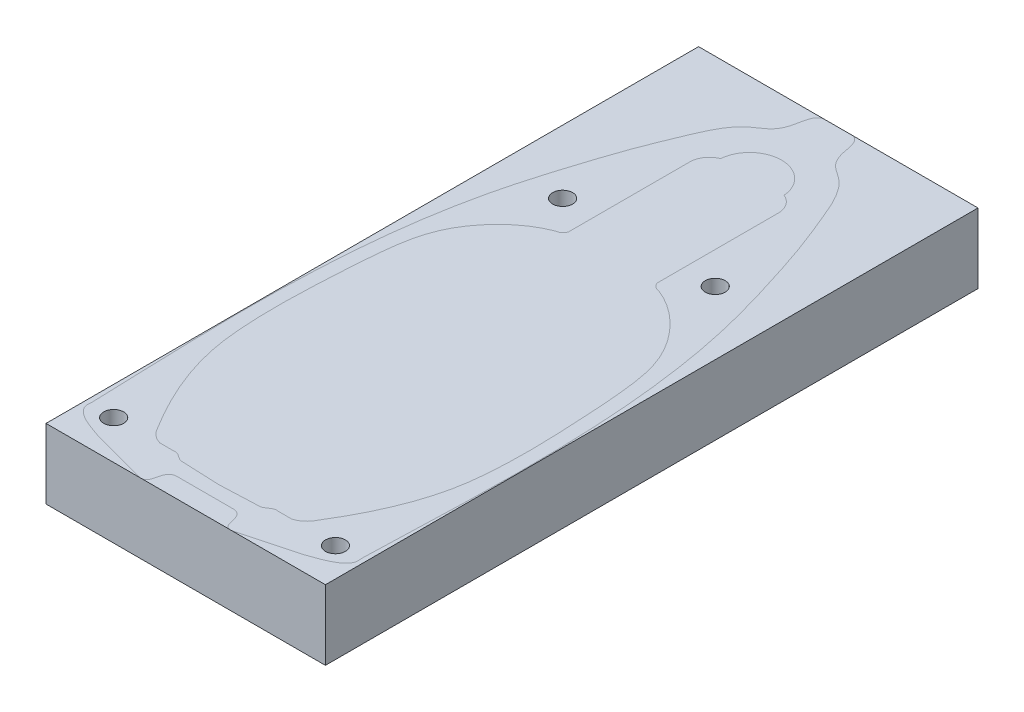
ISO-10303-21;
HEADER;
FILE_DESCRIPTION(('STEP AP214'),'2;1');
FILE_NAME('part.step','',(''),(''),'','','');
FILE_SCHEMA(('AUTOMOTIVE_DESIGN { 1 0 10303 214 1 1 1 1 }'));
ENDSEC;
DATA;
#1=APPLICATION_CONTEXT('core data for automotive mechanical design processes');
#2=APPLICATION_PROTOCOL_DEFINITION('international standard','automotive_design',2000,#1);
#3=PRODUCT_CONTEXT('',#1,'mechanical');
#4=PRODUCT('Part','Part','',(#3));
#5=PRODUCT_RELATED_PRODUCT_CATEGORY('part','',(#4));
#6=PRODUCT_DEFINITION_FORMATION('','',#4);
#7=PRODUCT_DEFINITION_CONTEXT('part definition',#1,'design');
#8=PRODUCT_DEFINITION('design','',#6,#7);
#9=PRODUCT_DEFINITION_SHAPE('','',#8);
#10=(LENGTH_UNIT() NAMED_UNIT(*) SI_UNIT(.MILLI.,.METRE.));
#11=(NAMED_UNIT(*) PLANE_ANGLE_UNIT() SI_UNIT($,.RADIAN.));
#12=(NAMED_UNIT(*) SI_UNIT($,.STERADIAN.) SOLID_ANGLE_UNIT());
#13=UNCERTAINTY_MEASURE_WITH_UNIT(LENGTH_MEASURE(1.E-05),#10,'distance_accuracy_value','');
#14=(GEOMETRIC_REPRESENTATION_CONTEXT(3) GLOBAL_UNCERTAINTY_ASSIGNED_CONTEXT((#13)) GLOBAL_UNIT_ASSIGNED_CONTEXT((#10,
#11,#12)) REPRESENTATION_CONTEXT('',''));
#15=CARTESIAN_POINT('',(0.,0.,0.));
#16=DIRECTION('',(0.,0.,1.));
#17=DIRECTION('',(1.,0.,0.));
#18=AXIS2_PLACEMENT_3D('',#15,#16,#17);
#19=CARTESIAN_POINT('',(0.,0.,0.));
#20=DIRECTION('',(0.,1.,0.));
#21=DIRECTION('',(0.,0.,1.));
#22=AXIS2_PLACEMENT_3D('',#19,#20,#21);
#23=PLANE('',#22);
#24=CARTESIAN_POINT('',(49.0771390945343,0.,5.29231725308454));
#25=CARTESIAN_POINT('',(50.0643876971976,0.,-26.1166546003382));
#26=CARTESIAN_POINT('',(52.5308597652175,0.,-73.6432190761408));
#27=CARTESIAN_POINT('',(44.7383078884643,0.,-128.665983430975));
#28=CARTESIAN_POINT('',(35.9601332946944,0.,-157.773461945844));
#29=CARTESIAN_POINT('',(30.5496339932385,0.,-174.097860196995));
#30=CARTESIAN_POINT('',(25.1053448282694,0.,-187.023597166548));
#31=CARTESIAN_POINT('',(21.9225096731139,0.,-195.198487494332));
#32=CARTESIAN_POINT('',(17.1350520974341,0.,-200.878659028551));
#33=CARTESIAN_POINT('',(13.9883491589994,0.,-202.878315551012));
#34=CARTESIAN_POINT('',(10.4503111705911,0.,-205.542036854755));
#35=CARTESIAN_POINT('',(8.81846815225018,0.,-209.809743179157));
#36=CARTESIAN_POINT('',(8.28664446761546,0.,-214.603179479271));
#37=CARTESIAN_POINT('',(6.56648538168442,0.,-217.643267046185));
#38=CARTESIAN_POINT('',(4.44551305669855,0.,-217.442534032527));
#39=B_SPLINE_CURVE_WITH_KNOTS('',3,(#24,#25,#26,#27,#28,#29,#30,#31,#32,#33,#34,#35,#36,#37,
#38),.UNSPECIFIED.,.F.,.F.,(4,1,1,1,1,1,1,1,1,1,1,1,4),(0.,0.403543259874789,0.608256673125079,
0.708690029533401,0.793482633199347,0.828511750834164,0.889032788817372,0.904436963315368,
0.922735578708441,0.936741401648004,0.960440646033117,0.977903149186417,1.),.UNSPECIFIED.);
#40=CARTESIAN_POINT('',(5.10291944520036,0.,-217.442534032527));
#41=VERTEX_POINT('',#40);
#42=CARTESIAN_POINT('',(49.0771390945343,0.,5.29231725308449));
#43=VERTEX_POINT('',#42);
#44=EDGE_CURVE('E376',#41,#43,#39,.F.);
#45=ORIENTED_EDGE('',*,*,#44,.F.);
#46=DIRECTION('',(1.,0.,0.));
#47=VECTOR('',#46,1.);
#48=CARTESIAN_POINT('',(0.,0.,-217.442534032527));
#49=LINE('',#48,#47);
#50=CARTESIAN_POINT('',(4.44551305669855,0.,-217.442534032527));
#51=VERTEX_POINT('',#50);
#52=EDGE_CURVE('E284',#51,#41,#49,.T.);
#53=ORIENTED_EDGE('',*,*,#52,.F.);
#54=DIRECTION('',(1.,0.,0.));
#55=VECTOR('',#54,1.);
#56=CARTESIAN_POINT('',(0.,0.,-217.442534032527));
#57=LINE('',#56,#55);
#58=CARTESIAN_POINT('',(-5.10291944519914,0.,-217.442534032527));
#59=VERTEX_POINT('',#58);
#60=EDGE_CURVE('E288',#59,#51,#57,.T.);
#61=ORIENTED_EDGE('',*,*,#60,.F.);
#62=CARTESIAN_POINT('',(-4.44551305669855,0.,-217.442534032527));
#63=CARTESIAN_POINT('',(-6.56648538168442,0.,-217.643267046185));
#64=CARTESIAN_POINT('',(-8.28664446761557,0.,-214.603179479271));
#65=CARTESIAN_POINT('',(-8.81846815225012,0.,-209.809743179157));
#66=CARTESIAN_POINT('',(-10.4503111705909,0.,-205.542036854756));
#67=CARTESIAN_POINT('',(-13.9883491589995,0.,-202.878315551012));
#68=CARTESIAN_POINT('',(-17.135052097434,0.,-200.878659028551));
#69=CARTESIAN_POINT('',(-21.922509673114,0.,-195.198487494332));
#70=CARTESIAN_POINT('',(-25.1053448282694,0.,-187.023597166548));
#71=CARTESIAN_POINT('',(-30.5496339932385,0.,-174.097860196995));
#72=CARTESIAN_POINT('',(-35.9601332946944,0.,-157.773461945844));
#73=CARTESIAN_POINT('',(-44.7383078884644,0.,-128.665983430975));
#74=CARTESIAN_POINT('',(-52.5308597652175,0.,-73.6432190761409));
#75=CARTESIAN_POINT('',(-50.0643876971976,0.,-26.1166546003381));
#76=CARTESIAN_POINT('',(-49.0771390945343,0.,5.29231725308466));
#77=B_SPLINE_CURVE_WITH_KNOTS('',3,(#62,#63,#64,#65,#66,#67,#68,#69,#70,#71,#72,#73,#74,#75,
#76),.UNSPECIFIED.,.F.,.F.,(4,1,1,1,1,1,1,1,1,1,1,1,4),(0.,0.0220968508135826,
0.0395593539668829,0.0632585983519958,0.0772644212915593,0.0955630366846325,0.110967211182628,
0.171488249165836,0.206517366800653,0.291309970466599,0.391743326874921,0.596456740125211,1.),.UNSPECIFIED.);
#78=CARTESIAN_POINT('',(-49.0771390945343,0.,5.2923172530846));
#79=VERTEX_POINT('',#78);
#80=EDGE_CURVE('E360',#79,#59,#77,.F.);
#81=ORIENTED_EDGE('',*,*,#80,.F.);
#82=CARTESIAN_POINT('',(-49.0771390945343,0.,5.2923172530846));
#83=CARTESIAN_POINT('',(-50.5688883170867,0.,10.9400693856976));
#84=CARTESIAN_POINT('',(-38.8328719776198,0.,13.504300857401));
#85=CARTESIAN_POINT('',(-37.419094930345,0.,14.3418901157242));
#86=B_SPLINE_CURVE_WITH_KNOTS('',3,(#82,#83,#84,#85),.UNSPECIFIED.,.F.,.F.,(4,4),(0.,1.),.UNSPECIFIED.);
#87=CARTESIAN_POINT('',(-37.419094930345,0.,14.3418901157242));
#88=VERTEX_POINT('',#87);
#89=EDGE_CURVE('E354',#88,#79,#86,.F.);
#90=ORIENTED_EDGE('',*,*,#89,.F.);
#91=DIRECTION('',(-0.966268306599688,0.,-0.257537491757941));
#92=VECTOR('',#91,1.);
#93=CARTESIAN_POINT('',(-6.05082630126968,0.,22.702409826807));
#94=LINE('',#93,#92);
#95=CARTESIAN_POINT('',(-18.3852400543082,0.,19.4149440592082));
#96=VERTEX_POINT('',#95);
#97=EDGE_CURVE('E350',#96,#88,#94,.T.);
#98=ORIENTED_EDGE('',*,*,#97,.F.);
#99=CARTESIAN_POINT('',(-18.3852400543082,0.,19.4149440592082));
#100=CARTESIAN_POINT('',(-11.6134098720276,0.,21.8048769182164));
#101=CARTESIAN_POINT('',(-15.7198055855271,0.,13.4117589348677));
#102=CARTESIAN_POINT('',(-10.5714203288874,0.,12.7273836483514));
#103=B_SPLINE_CURVE_WITH_KNOTS('',3,(#99,#100,#101,#102),.UNSPECIFIED.,.F.,.F.,(4,4),(0.,1.),.UNSPECIFIED.);
#104=CARTESIAN_POINT('',(-16.3294710793143,0.,19.8418554112533));
#105=VERTEX_POINT('',#104);
#106=EDGE_CURVE('E344',#105,#96,#103,.F.);
#107=ORIENTED_EDGE('',*,*,#106,.F.);
#108=CARTESIAN_POINT('',(-10.5714203288874,0.,12.7273836483514));
#109=VERTEX_POINT('',#108);
#110=EDGE_CURVE('E337',#109,#105,#103,.F.);
#111=ORIENTED_EDGE('',*,*,#110,.F.);
#112=DIRECTION('',(-1.,0.,0.));
#113=VECTOR('',#112,1.);
#114=CARTESIAN_POINT('',(0.,0.,12.7273836483513));
#115=LINE('',#114,#113);
#116=CARTESIAN_POINT('',(10.5714203288874,0.,12.7273836483514));
#117=VERTEX_POINT('',#116);
#118=EDGE_CURVE('E330',#117,#109,#115,.T.);
#119=ORIENTED_EDGE('',*,*,#118,.F.);
#120=CARTESIAN_POINT('',(10.5714203288874,0.,12.7273836483514));
#121=CARTESIAN_POINT('',(15.7198055855273,0.,13.4117589348679));
#122=CARTESIAN_POINT('',(11.6134098720275,0.,21.804876918216));
#123=CARTESIAN_POINT('',(18.3852400543081,0.,19.4149440592081));
#124=B_SPLINE_CURVE_WITH_KNOTS('',3,(#120,#121,#122,#123),.UNSPECIFIED.,.F.,.F.,(4,4),(0.,1.),.UNSPECIFIED.);
#125=CARTESIAN_POINT('',(16.3294710793472,0.,19.8418554112533));
#126=VERTEX_POINT('',#125);
#127=EDGE_CURVE('E323',#126,#117,#124,.F.);
#128=ORIENTED_EDGE('',*,*,#127,.F.);
#129=CARTESIAN_POINT('',(18.3852400543081,0.,19.4149440592081));
#130=VERTEX_POINT('',#129);
#131=EDGE_CURVE('E329',#130,#126,#124,.F.);
#132=ORIENTED_EDGE('',*,*,#131,.F.);
#133=DIRECTION('',(-0.966268306599688,0.,0.25753749175794));
#134=VECTOR('',#133,1.);
#135=CARTESIAN_POINT('',(6.05082630126964,0.,22.7024098268069));
#136=LINE('',#135,#134);
#137=CARTESIAN_POINT('',(37.419094930345,0.,14.3418901157241));
#138=VERTEX_POINT('',#137);
#139=EDGE_CURVE('E343',#138,#130,#136,.T.);
#140=ORIENTED_EDGE('',*,*,#139,.F.);
#141=CARTESIAN_POINT('',(37.419094930345,0.,14.3418901157241));
#142=CARTESIAN_POINT('',(38.832871977619,0.,13.5043008574007));
#143=CARTESIAN_POINT('',(50.5688883170869,0.,10.9400693856976));
#144=CARTESIAN_POINT('',(49.0771390945343,0.,5.29231725308449));
#145=B_SPLINE_CURVE_WITH_KNOTS('',3,(#141,#142,#143,#144),.UNSPECIFIED.,.F.,.F.,(4,4),(0.,1.),.UNSPECIFIED.);
#146=EDGE_CURVE('E368',#43,#138,#145,.F.);
#147=ORIENTED_EDGE('',*,*,#146,.F.);
#148=EDGE_LOOP('',(#45,#53,#61,#81,#90,#98,#107,#111,#119,#128,#132,#140,#147));
#149=FACE_BOUND('',#148,.T.);
#150=CARTESIAN_POINT('',(40.3206229095368,0.,5.71600751054374));
#151=DIRECTION('',(0.,1.,0.));
#152=DIRECTION('',(0.,0.,1.));
#153=AXIS2_PLACEMENT_3D('',#150,#151,#152);
#154=CIRCLE('',#153,3.6247382617778);
#155=CARTESIAN_POINT('',(40.3206229095368,0.,9.34074577232154));
#156=VERTEX_POINT('',#155);
#157=EDGE_CURVE('E305',#156,#156,#154,.F.);
#158=ORIENTED_EDGE('',*,*,#157,.T.);
#159=EDGE_LOOP('',(#158));
#160=FACE_BOUND('',#159,.T.);
#161=CARTESIAN_POINT('',(-40.3206229095368,0.,5.71600751054385));
#162=DIRECTION('',(0.,1.,0.));
#163=DIRECTION('',(0.,0.,1.));
#164=AXIS2_PLACEMENT_3D('',#161,#162,#163);
#165=CIRCLE('',#164,3.62473826177782);
#166=CARTESIAN_POINT('',(-40.3206229095368,0.,9.34074577232168));
#167=VERTEX_POINT('',#166);
#168=EDGE_CURVE('E308',#167,#167,#165,.T.);
#169=ORIENTED_EDGE('',*,*,#168,.F.);
#170=EDGE_LOOP('',(#169));
#171=FACE_BOUND('',#170,.T.);
#172=CARTESIAN_POINT('',(-27.7449906587386,0.,-144.952451062197));
#173=DIRECTION('',(0.,1.,0.));
#174=DIRECTION('',(0.,0.,1.));
#175=AXIS2_PLACEMENT_3D('',#172,#173,#174);
#176=CIRCLE('',#175,3.62473826177782);
#177=CARTESIAN_POINT('',(-27.7449906587386,0.,-141.327712800419));
#178=VERTEX_POINT('',#177);
#179=EDGE_CURVE('E206',#178,#178,#176,.T.);
#180=ORIENTED_EDGE('',*,*,#179,.F.);
#181=EDGE_LOOP('',(#180));
#182=FACE_BOUND('',#181,.T.);
#183=CARTESIAN_POINT('',(27.7449906587385,0.,-144.952451062197));
#184=DIRECTION('',(0.,1.,0.));
#185=DIRECTION('',(0.,0.,1.));
#186=AXIS2_PLACEMENT_3D('',#183,#184,#185);
#187=CIRCLE('',#186,3.6247382617778);
#188=CARTESIAN_POINT('',(27.7449906587385,0.,-141.327712800419));
#189=VERTEX_POINT('',#188);
#190=EDGE_CURVE('E203',#189,#189,#187,.F.);
#191=ORIENTED_EDGE('',*,*,#190,.T.);
#192=EDGE_LOOP('',(#191));
#193=FACE_BOUND('',#192,.T.);
#194=DIRECTION('',(0.,0.,-1.));
#195=VECTOR('',#194,1.);
#196=CARTESIAN_POINT('',(-16.1045382347162,0.,0.));
#197=LINE('',#196,#195);
#198=CARTESIAN_POINT('',(-16.1045382347163,0.,-135.534945765243));
#199=VERTEX_POINT('',#198);
#200=CARTESIAN_POINT('',(-16.1045382347162,0.,-179.48987237625));
#201=VERTEX_POINT('',#200);
#202=EDGE_CURVE('E52',#199,#201,#197,.T.);
#203=ORIENTED_EDGE('',*,*,#202,.T.);
#204=CARTESIAN_POINT('',(-8.92288832461977,0.,-179.48987237625));
#205=DIRECTION('',(0.,1.,0.));
#206=DIRECTION('',(0.,0.,1.));
#207=AXIS2_PLACEMENT_3D('',#204,#205,#206);
#208=CIRCLE('',#207,7.18164991009649);
#209=CARTESIAN_POINT('',(-11.5472751039841,0.,-186.174832321043));
#210=VERTEX_POINT('',#209);
#211=EDGE_CURVE('E11',#201,#210,#208,.F.);
#212=ORIENTED_EDGE('',*,*,#211,.T.);
#213=CARTESIAN_POINT('',(0.,0.,-185.222255850204));
#214=DIRECTION('',(0.,1.,0.));
#215=DIRECTION('',(0.,0.,1.));
#216=AXIS2_PLACEMENT_3D('',#213,#214,#215);
#217=CIRCLE('',#216,11.5864992236605);
#218=CARTESIAN_POINT('',(11.5472751039841,0.,-186.174832321043));
#219=VERTEX_POINT('',#218);
#220=EDGE_CURVE('E384',#210,#219,#217,.F.);
#221=ORIENTED_EDGE('',*,*,#220,.T.);
#222=CARTESIAN_POINT('',(8.92288832461979,0.,-179.48987237625));
#223=DIRECTION('',(0.,1.,0.));
#224=DIRECTION('',(0.,0.,1.));
#225=AXIS2_PLACEMENT_3D('',#222,#223,#224);
#226=CIRCLE('',#225,7.18164991009647);
#227=CARTESIAN_POINT('',(16.1045382347163,0.,-179.48987237625));
#228=VERTEX_POINT('',#227);
#229=EDGE_CURVE('E391',#219,#228,#226,.F.);
#230=ORIENTED_EDGE('',*,*,#229,.T.);
#231=DIRECTION('',(0.,0.,1.));
#232=VECTOR('',#231,1.);
#233=CARTESIAN_POINT('',(16.1045382347162,0.,0.));
#234=LINE('',#233,#232);
#235=CARTESIAN_POINT('',(16.1045382347162,0.,-135.534945765243));
#236=VERTEX_POINT('',#235);
#237=EDGE_CURVE('E395',#228,#236,#234,.T.);
#238=ORIENTED_EDGE('',*,*,#237,.T.);
#239=CARTESIAN_POINT('',(19.0012718307022,0.,-136.351122874709));
#240=DIRECTION('',(0.,1.,0.));
#241=DIRECTION('',(0.,0.,1.));
#242=AXIS2_PLACEMENT_3D('',#239,#240,#241);
#243=CIRCLE('',#242,3.00951999497092);
#244=CARTESIAN_POINT('',(18.7446615171418,0.,-133.352562929151));
#245=VERTEX_POINT('',#244);
#246=EDGE_CURVE('E399',#236,#245,#243,.T.);
#247=ORIENTED_EDGE('',*,*,#246,.T.);
#248=CARTESIAN_POINT('',(28.9897543021521,0.,1.11262704182102));
#249=CARTESIAN_POINT('',(35.9471156603791,0.,-10.0985478623123));
#250=CARTESIAN_POINT('',(43.216376698589,0.,-25.6573281184342));
#251=CARTESIAN_POINT('',(45.6029115810602,0.,-47.6860224426251));
#252=CARTESIAN_POINT('',(45.8816375135089,0.,-62.8086245314313));
#253=CARTESIAN_POINT('',(45.0500773289797,0.,-79.5297272696832));
#254=CARTESIAN_POINT('',(43.965647760869,0.,-96.1245135547548));
#255=CARTESIAN_POINT('',(41.637553201633,0.,-111.373856913353));
#256=CARTESIAN_POINT('',(32.6029748866559,0.,-124.998790744143));
#257=CARTESIAN_POINT('',(24.0724426524856,0.,-131.292430099998));
#258=CARTESIAN_POINT('',(18.7446615171418,0.,-133.352562929151));
#259=B_SPLINE_CURVE_WITH_KNOTS('',3,(#248,#249,#250,#251,#252,#253,#254,#255,#256,#257,#258),
.UNSPECIFIED.,.F.,.F.,(4,1,1,1,1,1,1,1,4),(0.,0.270443115932794,0.337210977163026,
0.449064606803327,0.577405053328751,0.676752021145974,0.788024920003265,0.885248270529085,1.),.UNSPECIFIED.);
#260=CARTESIAN_POINT('',(28.9897543021521,0.,1.11262704182102));
#261=VERTEX_POINT('',#260);
#262=EDGE_CURVE('E403',#245,#261,#259,.F.);
#263=ORIENTED_EDGE('',*,*,#262,.T.);
#264=CARTESIAN_POINT('',(23.9297097430107,0.,5.29231725308449));
#265=CARTESIAN_POINT('',(26.1031516888282,0.,4.73079484247713));
#266=CARTESIAN_POINT('',(27.9741559493832,0.,3.09986950265528));
#267=CARTESIAN_POINT('',(28.9897543021521,0.,1.11262704182102));
#268=B_SPLINE_CURVE_WITH_KNOTS('',3,(#264,#265,#266,#267),.UNSPECIFIED.,.F.,.F.,(4,4),(0.,1.),.UNSPECIFIED.);
#269=CARTESIAN_POINT('',(23.9297097430107,0.,5.29231725308449));
#270=VERTEX_POINT('',#269);
#271=EDGE_CURVE('E409',#261,#270,#268,.F.);
#272=ORIENTED_EDGE('',*,*,#271,.T.);
#273=DIRECTION('',(-1.,0.,0.));
#274=VECTOR('',#273,1.);
#275=CARTESIAN_POINT('',(0.,0.,5.29231725308449));
#276=LINE('',#275,#274);
#277=CARTESIAN_POINT('',(19.0012718307022,0.,5.29231725308449));
#278=VERTEX_POINT('',#277);
#279=EDGE_CURVE('E418',#270,#278,#276,.T.);
#280=ORIENTED_EDGE('',*,*,#279,.T.);
#281=CARTESIAN_POINT('',(14.3058881807214,0.,7.10813264219567));
#282=CARTESIAN_POINT('',(16.0767091536674,0.,6.85623125618423));
#283=CARTESIAN_POINT('',(16.9934407863588,0.,4.84756479524606));
#284=CARTESIAN_POINT('',(19.0012718307022,0.,5.29231725308449));
#285=B_SPLINE_CURVE_WITH_KNOTS('',3,(#281,#282,#283,#284),.UNSPECIFIED.,.F.,.F.,(4,4),(0.,1.),.UNSPECIFIED.);
#286=CARTESIAN_POINT('',(14.3058881807214,0.,7.10813264219567));
#287=VERTEX_POINT('',#286);
#288=EDGE_CURVE('E425',#278,#287,#285,.F.);
#289=ORIENTED_EDGE('',*,*,#288,.T.);
#290=DIRECTION('',(-0.999106162356931,0.,0.0422714601167913));
#291=VECTOR('',#290,1.);
#292=CARTESIAN_POINT('',(0.32576542618756,0.,7.69962153868293));
#293=LINE('',#292,#291);
#294=CARTESIAN_POINT('',(0.,0.,7.71340443857821));
#295=VERTEX_POINT('',#294);
#296=EDGE_CURVE('E431',#287,#295,#293,.T.);
#297=ORIENTED_EDGE('',*,*,#296,.T.);
#298=DIRECTION('',(-0.999106162356932,0.,-0.0422714601167836));
#299=VECTOR('',#298,1.);
#300=CARTESIAN_POINT('',(-0.3257654261875,0.,7.69962153868294));
#301=LINE('',#300,#299);
#302=CARTESIAN_POINT('',(-14.3058881807214,0.,7.10813264219579));
#303=VERTEX_POINT('',#302);
#304=EDGE_CURVE('E438',#295,#303,#301,.T.);
#305=ORIENTED_EDGE('',*,*,#304,.T.);
#306=CARTESIAN_POINT('',(-19.0012718307022,0.,5.2923172530846));
#307=CARTESIAN_POINT('',(-16.9934407863586,0.,4.84756479524601));
#308=CARTESIAN_POINT('',(-16.0767091536676,0.,6.85623125618451));
#309=CARTESIAN_POINT('',(-14.3058881807214,0.,7.10813264219579));
#310=B_SPLINE_CURVE_WITH_KNOTS('',3,(#306,#307,#308,#309),.UNSPECIFIED.,.F.,.F.,(4,4),(0.,1.),.UNSPECIFIED.);
#311=CARTESIAN_POINT('',(-19.0012718307022,0.,5.2923172530846));
#312=VERTEX_POINT('',#311);
#313=EDGE_CURVE('E442',#303,#312,#310,.F.);
#314=ORIENTED_EDGE('',*,*,#313,.T.);
#315=DIRECTION('',(-1.,0.,0.));
#316=VECTOR('',#315,1.);
#317=CARTESIAN_POINT('',(0.,0.,5.2923172530846));
#318=LINE('',#317,#316);
#319=CARTESIAN_POINT('',(-23.9297097430108,0.,5.2923172530846));
#320=VERTEX_POINT('',#319);
#321=EDGE_CURVE('E448',#312,#320,#318,.T.);
#322=ORIENTED_EDGE('',*,*,#321,.T.);
#323=CARTESIAN_POINT('',(-28.9897543021521,0.,1.11262704182113));
#324=CARTESIAN_POINT('',(-27.9741559493833,0.,3.09986950265539));
#325=CARTESIAN_POINT('',(-26.1031516888281,0.,4.73079484247724));
#326=CARTESIAN_POINT('',(-23.9297097430108,0.,5.2923172530846));
#327=B_SPLINE_CURVE_WITH_KNOTS('',3,(#323,#324,#325,#326),.UNSPECIFIED.,.F.,.F.,(4,4),(0.,1.),.UNSPECIFIED.);
#328=CARTESIAN_POINT('',(-28.9897543021521,0.,1.11262704182113));
#329=VERTEX_POINT('',#328);
#330=EDGE_CURVE('E455',#320,#329,#327,.F.);
#331=ORIENTED_EDGE('',*,*,#330,.T.);
#332=CARTESIAN_POINT('',(-18.7446615171418,0.,-133.352562929151));
#333=CARTESIAN_POINT('',(-24.0724426524855,0.,-131.292430099998));
#334=CARTESIAN_POINT('',(-32.602974886656,0.,-124.998790744143));
#335=CARTESIAN_POINT('',(-41.637553201633,0.,-111.373856913353));
#336=CARTESIAN_POINT('',(-43.965647760869,0.,-96.1245135547549));
#337=CARTESIAN_POINT('',(-45.0500773289798,0.,-79.5297272696831));
#338=CARTESIAN_POINT('',(-45.8816375135087,0.,-62.8086245314311));
#339=CARTESIAN_POINT('',(-45.6029115810603,0.,-47.686022442625));
#340=CARTESIAN_POINT('',(-43.2163766985889,0.,-25.657328118434));
#341=CARTESIAN_POINT('',(-35.9471156603794,0.,-10.0985478623124));
#342=CARTESIAN_POINT('',(-28.9897543021521,0.,1.11262704182108));
#343=B_SPLINE_CURVE_WITH_KNOTS('',3,(#332,#333,#334,#335,#336,#337,#338,#339,#340,#341,#342),
.UNSPECIFIED.,.F.,.F.,(4,1,1,1,1,1,1,1,4),(0.,0.114751729470915,0.211975079996735,
0.323247978854026,0.422594946671248,0.550935393196673,0.662789022836974,0.729556884067206,1.),.UNSPECIFIED.);
#344=CARTESIAN_POINT('',(-18.7446615171418,0.,-133.352562929151));
#345=VERTEX_POINT('',#344);
#346=EDGE_CURVE('E461',#329,#345,#343,.F.);
#347=ORIENTED_EDGE('',*,*,#346,.T.);
#348=CARTESIAN_POINT('',(-19.0012718307022,0.,-136.351122874709));
#349=DIRECTION('',(0.,1.,0.));
#350=DIRECTION('',(0.,0.,1.));
#351=AXIS2_PLACEMENT_3D('',#348,#349,#350);
#352=CIRCLE('',#351,3.00951999497094);
#353=EDGE_CURVE('E470',#345,#199,#352,.T.);
#354=ORIENTED_EDGE('',*,*,#353,.T.);
#355=EDGE_LOOP('',(#203,#212,#221,#230,#238,#247,#263,#272,#280,#289,#297,#305,#314,#322,#331,
#347,#354));
#356=FACE_BOUND('',#355,.T.);
#357=ADVANCED_FACE('F43',(#149,#160,#171,#182,#193,#356),#23,.T.);
#358=DIRECTION('',(1.,0.,0.));
#359=VECTOR('',#358,1.);
#360=CARTESIAN_POINT('',(0.,0.,-217.442534032527));
#361=LINE('',#360,#359);
#362=CARTESIAN_POINT('',(50.8,0.,-217.442534032527));
#363=VERTEX_POINT('',#362);
#364=EDGE_CURVE('E289',#41,#363,#361,.T.);
#365=ORIENTED_EDGE('',*,*,#364,.F.);
#366=ORIENTED_EDGE('',*,*,#44,.T.);
#367=ORIENTED_EDGE('',*,*,#146,.T.);
#368=ORIENTED_EDGE('',*,*,#139,.T.);
#369=ORIENTED_EDGE('',*,*,#131,.T.);
#370=DIRECTION('',(1.,0.,0.));
#371=VECTOR('',#370,1.);
#372=CARTESIAN_POINT('',(0.,0.,19.8418554112533));
#373=LINE('',#372,#371);
#374=CARTESIAN_POINT('',(50.8,0.,19.8418554112533));
#375=VERTEX_POINT('',#374);
#376=EDGE_CURVE('E542',#126,#375,#373,.T.);
#377=ORIENTED_EDGE('',*,*,#376,.T.);
#378=DIRECTION('',(0.,0.,1.));
#379=VECTOR('',#378,1.);
#380=CARTESIAN_POINT('',(50.8,0.,0.));
#381=LINE('',#380,#379);
#382=EDGE_CURVE('E195',#363,#375,#381,.T.);
#383=ORIENTED_EDGE('',*,*,#382,.F.);
#384=EDGE_LOOP('',(#365,#366,#367,#368,#369,#377,#383));
#385=FACE_BOUND('',#384,.T.);
#386=ADVANCED_FACE('F248',(#385),#23,.T.);
#387=ORIENTED_EDGE('',*,*,#89,.T.);
#388=ORIENTED_EDGE('',*,*,#80,.T.);
#389=CARTESIAN_POINT('',(-50.8,0.,-217.442534032527));
#390=VERTEX_POINT('',#389);
#391=EDGE_CURVE('E291',#390,#59,#57,.T.);
#392=ORIENTED_EDGE('',*,*,#391,.F.);
#393=DIRECTION('',(0.,0.,1.));
#394=VECTOR('',#393,1.);
#395=CARTESIAN_POINT('',(-50.8,0.,0.));
#396=LINE('',#395,#394);
#397=CARTESIAN_POINT('',(-50.8,0.,19.8418554112533));
#398=VERTEX_POINT('',#397);
#399=EDGE_CURVE('E302',#390,#398,#396,.T.);
#400=ORIENTED_EDGE('',*,*,#399,.T.);
#401=EDGE_CURVE('E538',#398,#105,#373,.T.);
#402=ORIENTED_EDGE('',*,*,#401,.T.);
#403=ORIENTED_EDGE('',*,*,#106,.T.);
#404=ORIENTED_EDGE('',*,*,#97,.T.);
#405=EDGE_LOOP('',(#387,#388,#392,#400,#402,#403,#404));
#406=FACE_BOUND('',#405,.T.);
#407=ADVANCED_FACE('F255',(#406),#23,.T.);
#408=ORIENTED_EDGE('',*,*,#118,.T.);
#409=ORIENTED_EDGE('',*,*,#110,.T.);
#410=EDGE_CURVE('E541',#105,#126,#373,.T.);
#411=ORIENTED_EDGE('',*,*,#410,.T.);
#412=ORIENTED_EDGE('',*,*,#127,.T.);
#413=EDGE_LOOP('',(#408,#409,#411,#412));
#414=FACE_BOUND('',#413,.T.);
#415=ADVANCED_FACE('F271',(#414),#23,.T.);
#416=CARTESIAN_POINT('',(4.44551305669855,0.,-217.442534032527));
#417=CARTESIAN_POINT('',(6.56648538168442,0.,-217.643267046185));
#418=CARTESIAN_POINT('',(8.28664446761546,0.,-214.603179479271));
#419=CARTESIAN_POINT('',(8.81846815225018,0.,-209.809743179157));
#420=CARTESIAN_POINT('',(10.4503111705911,0.,-205.542036854755));
#421=CARTESIAN_POINT('',(13.9883491589994,0.,-202.878315551012));
#422=CARTESIAN_POINT('',(17.1350520974341,0.,-200.878659028551));
#423=CARTESIAN_POINT('',(21.9225096731139,0.,-195.198487494332));
#424=CARTESIAN_POINT('',(25.1053448282694,0.,-187.023597166548));
#425=CARTESIAN_POINT('',(30.5496339932385,0.,-174.097860196995));
#426=CARTESIAN_POINT('',(35.9601332946944,0.,-157.773461945844));
#427=CARTESIAN_POINT('',(44.7383078884643,0.,-128.665983430975));
#428=CARTESIAN_POINT('',(52.5308597652175,0.,-73.6432190761408));
#429=CARTESIAN_POINT('',(50.0643876971976,0.,-26.1166546003382));
#430=CARTESIAN_POINT('',(49.0771390945343,0.,5.29231725308454));
#431=B_SPLINE_CURVE_WITH_KNOTS('',3,(#416,#417,#418,#419,#420,#421,#422,#423,#424,#425,#426,
#427,#428,#429,#430),.UNSPECIFIED.,.F.,.F.,(4,1,1,1,1,1,1,1,1,1,1,1,4),(0.,0.0220968508135825,
0.0395593539668829,0.0632585983519959,0.0772644212915592,0.0955630366846324,0.110967211182628,
0.171488249165836,0.206517366800653,0.291309970466599,0.391743326874921,0.596456740125211,1.),.UNSPECIFIED.);
#432=EDGE_CURVE('E282',#51,#41,#431,.T.);
#433=ORIENTED_EDGE('',*,*,#432,.F.);
#434=ORIENTED_EDGE('',*,*,#52,.T.);
#435=EDGE_LOOP('',(#433,#434));
#436=FACE_BOUND('',#435,.T.);
#437=ADVANCED_FACE('F261',(#436),#23,.T.);
#438=CARTESIAN_POINT('',(0.,-25.4,19.8418554112533));
#439=DIRECTION('',(0.,0.,1.));
#440=DIRECTION('',(1.,0.,0.));
#441=AXIS2_PLACEMENT_3D('',#438,#439,#440);
#442=PLANE('',#441);
#443=ORIENTED_EDGE('',*,*,#401,.F.);
#444=DIRECTION('',(0.,1.,0.));
#445=VECTOR('',#444,1.);
#446=CARTESIAN_POINT('',(-50.8,-25.4,19.8418554112533));
#447=LINE('',#446,#445);
#448=CARTESIAN_POINT('',(-50.8,-25.4,19.8418554112533));
#449=VERTEX_POINT('',#448);
#450=EDGE_CURVE('E202',#449,#398,#447,.T.);
#451=ORIENTED_EDGE('',*,*,#450,.F.);
#452=DIRECTION('',(1.,0.,0.));
#453=VECTOR('',#452,1.);
#454=CARTESIAN_POINT('',(0.,-25.4,19.8418554112533));
#455=LINE('',#454,#453);
#456=CARTESIAN_POINT('',(50.8,-25.4,19.8418554112533));
#457=VERTEX_POINT('',#456);
#458=EDGE_CURVE('E182',#449,#457,#455,.T.);
#459=ORIENTED_EDGE('',*,*,#458,.T.);
#460=DIRECTION('',(0.,1.,0.));
#461=VECTOR('',#460,1.);
#462=CARTESIAN_POINT('',(50.8,-25.4,19.8418554112533));
#463=LINE('',#462,#461);
#464=EDGE_CURVE('E192',#457,#375,#463,.T.);
#465=ORIENTED_EDGE('',*,*,#464,.T.);
#466=ORIENTED_EDGE('',*,*,#376,.F.);
#467=ORIENTED_EDGE('',*,*,#410,.F.);
#468=EDGE_LOOP('',(#443,#451,#459,#465,#466,#467));
#469=FACE_BOUND('',#468,.T.);
#470=ADVANCED_FACE('F45',(#469),#442,.T.);
#471=CARTESIAN_POINT('',(-50.8,-25.4,0.));
#472=DIRECTION('',(-1.,0.,0.));
#473=DIRECTION('',(0.,0.,1.));
#474=AXIS2_PLACEMENT_3D('',#471,#472,#473);
#475=PLANE('',#474);
#476=ORIENTED_EDGE('',*,*,#399,.F.);
#477=DIRECTION('',(0.,1.,0.));
#478=VECTOR('',#477,1.);
#479=CARTESIAN_POINT('',(-50.8,-25.4,-217.442534032527));
#480=LINE('',#479,#478);
#481=CARTESIAN_POINT('',(-50.8,-25.4,-217.442534032527));
#482=VERTEX_POINT('',#481);
#483=EDGE_CURVE('E314',#482,#390,#480,.T.);
#484=ORIENTED_EDGE('',*,*,#483,.F.);
#485=DIRECTION('',(0.,0.,1.));
#486=VECTOR('',#485,1.);
#487=CARTESIAN_POINT('',(-50.8,-25.4,0.));
#488=LINE('',#487,#486);
#489=EDGE_CURVE('E556',#482,#449,#488,.T.);
#490=ORIENTED_EDGE('',*,*,#489,.T.);
#491=ORIENTED_EDGE('',*,*,#450,.T.);
#492=EDGE_LOOP('',(#476,#484,#490,#491));
#493=FACE_BOUND('',#492,.T.);
#494=ADVANCED_FACE('F277',(#493),#475,.T.);
#495=CARTESIAN_POINT('',(0.,-25.4,-217.442534032527));
#496=DIRECTION('',(0.,0.,1.));
#497=DIRECTION('',(1.,0.,0.));
#498=AXIS2_PLACEMENT_3D('',#495,#496,#497);
#499=PLANE('',#498);
#500=ORIENTED_EDGE('',*,*,#391,.T.);
#501=ORIENTED_EDGE('',*,*,#60,.T.);
#502=DIRECTION('',(0.,1.,0.));
#503=VECTOR('',#502,1.);
#504=CARTESIAN_POINT('',(4.44551305669855,-25.4,-217.442534032527));
#505=LINE('',#504,#503);
#506=CARTESIAN_POINT('',(4.44551305669855,-25.4,-217.442534032527));
#507=VERTEX_POINT('',#506);
#508=EDGE_CURVE('E316',#507,#51,#505,.T.);
#509=ORIENTED_EDGE('',*,*,#508,.F.);
#510=DIRECTION('',(1.,0.,0.));
#511=VECTOR('',#510,1.);
#512=CARTESIAN_POINT('',(0.,-25.4,-217.442534032527));
#513=LINE('',#512,#511);
#514=EDGE_CURVE('E218',#482,#507,#513,.T.);
#515=ORIENTED_EDGE('',*,*,#514,.F.);
#516=ORIENTED_EDGE('',*,*,#483,.T.);
#517=EDGE_LOOP('',(#500,#501,#509,#515,#516));
#518=FACE_BOUND('',#517,.T.);
#519=ADVANCED_FACE('F229',(#518),#499,.F.);
#520=CARTESIAN_POINT('',(4.44551305669855,-25.4,-217.442534032527));
#521=CARTESIAN_POINT('',(6.56648538168442,-25.4,-217.643267046185));
#522=CARTESIAN_POINT('',(8.28664446761546,-25.4,-214.603179479271));
#523=CARTESIAN_POINT('',(8.81846815225018,-25.4,-209.809743179157));
#524=CARTESIAN_POINT('',(10.4503111705911,-25.4,-205.542036854755));
#525=CARTESIAN_POINT('',(13.9883491589994,-25.4,-202.878315551012));
#526=CARTESIAN_POINT('',(17.1350520974341,-25.4,-200.878659028551));
#527=CARTESIAN_POINT('',(21.9225096731139,-25.4,-195.198487494332));
#528=CARTESIAN_POINT('',(25.1053448282694,-25.4,-187.023597166548));
#529=CARTESIAN_POINT('',(30.5496339932385,-25.4,-174.097860196995));
#530=CARTESIAN_POINT('',(35.9601332946944,-25.4,-157.773461945844));
#531=CARTESIAN_POINT('',(44.7383078884643,-25.4,-128.665983430975));
#532=CARTESIAN_POINT('',(52.5308597652175,-25.4,-73.6432190761408));
#533=CARTESIAN_POINT('',(50.0643876971976,-25.4,-26.1166546003382));
#534=CARTESIAN_POINT('',(49.0771390945343,-25.4,5.29231725308454));
#535=B_SPLINE_CURVE_WITH_KNOTS('',3,(#520,#521,#522,#523,#524,#525,#526,#527,#528,#529,#530,
#531,#532,#533,#534),.UNSPECIFIED.,.F.,.F.,(4,1,1,1,1,1,1,1,1,1,1,1,4),(0.,0.0220968508135825,
0.0395593539668829,0.0632585983519959,0.0772644212915592,0.0955630366846324,0.110967211182628,
0.171488249165836,0.206517366800653,0.291309970466599,0.391743326874921,0.596456740125211,1.),.UNSPECIFIED.);
#536=DIRECTION('',(0.,1.,0.));
#537=VECTOR('',#536,1.);
#538=SURFACE_OF_LINEAR_EXTRUSION('',#535,#537);
#539=ORIENTED_EDGE('',*,*,#432,.T.);
#540=DIRECTION('',(0.,1.,0.));
#541=VECTOR('',#540,1.);
#542=CARTESIAN_POINT('',(5.10291944520036,-25.4,-217.442534032527));
#543=LINE('',#542,#541);
#544=CARTESIAN_POINT('',(5.10291944520036,-25.4,-217.442534032527));
#545=VERTEX_POINT('',#544);
#546=EDGE_CURVE('E318',#545,#41,#543,.T.);
#547=ORIENTED_EDGE('',*,*,#546,.F.);
#548=EDGE_CURVE('E213',#507,#545,#535,.T.);
#549=ORIENTED_EDGE('',*,*,#548,.F.);
#550=ORIENTED_EDGE('',*,*,#508,.T.);
#551=EDGE_LOOP('',(#539,#547,#549,#550));
#552=FACE_BOUND('',#551,.T.);
#553=ADVANCED_FACE('F224',(#552),#538,.F.);
#554=CARTESIAN_POINT('',(0.,-25.4,-217.442534032527));
#555=DIRECTION('',(0.,0.,1.));
#556=DIRECTION('',(1.,0.,0.));
#557=AXIS2_PLACEMENT_3D('',#554,#555,#556);
#558=PLANE('',#557);
#559=ORIENTED_EDGE('',*,*,#364,.T.);
#560=DIRECTION('',(0.,1.,0.));
#561=VECTOR('',#560,1.);
#562=CARTESIAN_POINT('',(50.8,-25.4,-217.442534032527));
#563=LINE('',#562,#561);
#564=CARTESIAN_POINT('',(50.8,-25.4,-217.442534032527));
#565=VERTEX_POINT('',#564);
#566=EDGE_CURVE('E198',#565,#363,#563,.T.);
#567=ORIENTED_EDGE('',*,*,#566,.F.);
#568=DIRECTION('',(1.,0.,0.));
#569=VECTOR('',#568,1.);
#570=CARTESIAN_POINT('',(0.,-25.4,-217.442534032527));
#571=LINE('',#570,#569);
#572=EDGE_CURVE('E185',#545,#565,#571,.T.);
#573=ORIENTED_EDGE('',*,*,#572,.F.);
#574=ORIENTED_EDGE('',*,*,#546,.T.);
#575=EDGE_LOOP('',(#559,#567,#573,#574));
#576=FACE_BOUND('',#575,.T.);
#577=ADVANCED_FACE('F228',(#576),#558,.F.);
#578=CARTESIAN_POINT('',(-27.7449906587386,-25.4,-144.952451062197));
#579=DIRECTION('',(0.,1.,0.));
#580=DIRECTION('',(0.,0.,1.));
#581=AXIS2_PLACEMENT_3D('',#578,#579,#580);
#582=CYLINDRICAL_SURFACE('',#581,3.62473826177782);
#583=CARTESIAN_POINT('',(-27.7449906587386,-25.4,-144.952451062197));
#584=DIRECTION('',(0.,1.,0.));
#585=DIRECTION('',(0.,0.,1.));
#586=AXIS2_PLACEMENT_3D('',#583,#584,#585);
#587=CIRCLE('',#586,3.62473826177782);
#588=CARTESIAN_POINT('',(-27.7449906587386,-25.4,-141.327712800419));
#589=VERTEX_POINT('',#588);
#590=EDGE_CURVE('E548',#589,#589,#587,.T.);
#591=ORIENTED_EDGE('',*,*,#590,.F.);
#592=EDGE_LOOP('',(#591));
#593=FACE_BOUND('',#592,.T.);
#594=ORIENTED_EDGE('',*,*,#179,.T.);
#595=EDGE_LOOP('',(#594));
#596=FACE_BOUND('',#595,.T.);
#597=ADVANCED_FACE('F233',(#593,#596),#582,.F.);
#598=CARTESIAN_POINT('',(-40.3206229095368,-25.4,5.71600751054385));
#599=DIRECTION('',(0.,1.,0.));
#600=DIRECTION('',(0.,0.,1.));
#601=AXIS2_PLACEMENT_3D('',#598,#599,#600);
#602=CYLINDRICAL_SURFACE('',#601,3.62473826177782);
#603=CARTESIAN_POINT('',(-40.3206229095368,-25.4,5.71600751054385));
#604=DIRECTION('',(0.,1.,0.));
#605=DIRECTION('',(0.,0.,1.));
#606=AXIS2_PLACEMENT_3D('',#603,#604,#605);
#607=CIRCLE('',#606,3.62473826177782);
#608=CARTESIAN_POINT('',(-40.3206229095368,-25.4,9.34074577232168));
#609=VERTEX_POINT('',#608);
#610=EDGE_CURVE('E551',#609,#609,#607,.T.);
#611=ORIENTED_EDGE('',*,*,#610,.F.);
#612=EDGE_LOOP('',(#611));
#613=FACE_BOUND('',#612,.T.);
#614=ORIENTED_EDGE('',*,*,#168,.T.);
#615=EDGE_LOOP('',(#614));
#616=FACE_BOUND('',#615,.T.);
#617=ADVANCED_FACE('F244',(#613,#616),#602,.F.);
#618=CARTESIAN_POINT('',(40.3206229095368,-25.4,5.71600751054374));
#619=DIRECTION('',(0.,1.,0.));
#620=DIRECTION('',(0.,0.,1.));
#621=AXIS2_PLACEMENT_3D('',#618,#619,#620);
#622=CYLINDRICAL_SURFACE('',#621,3.6247382617778);
#623=CARTESIAN_POINT('',(40.3206229095368,-25.4,5.71600751054374));
#624=DIRECTION('',(0.,1.,0.));
#625=DIRECTION('',(0.,0.,1.));
#626=AXIS2_PLACEMENT_3D('',#623,#624,#625);
#627=CIRCLE('',#626,3.6247382617778);
#628=CARTESIAN_POINT('',(40.3206229095368,-25.4,9.34074577232154));
#629=VERTEX_POINT('',#628);
#630=EDGE_CURVE('E554',#629,#629,#627,.F.);
#631=ORIENTED_EDGE('',*,*,#630,.T.);
#632=EDGE_LOOP('',(#631));
#633=FACE_BOUND('',#632,.T.);
#634=ORIENTED_EDGE('',*,*,#157,.F.);
#635=EDGE_LOOP('',(#634));
#636=FACE_BOUND('',#635,.T.);
#637=ADVANCED_FACE('F237',(#633,#636),#622,.F.);
#638=CARTESIAN_POINT('',(50.8,-25.4,0.));
#639=DIRECTION('',(-1.,0.,0.));
#640=DIRECTION('',(0.,0.,1.));
#641=AXIS2_PLACEMENT_3D('',#638,#639,#640);
#642=PLANE('',#641);
#643=ORIENTED_EDGE('',*,*,#382,.T.);
#644=ORIENTED_EDGE('',*,*,#464,.F.);
#645=DIRECTION('',(0.,0.,1.));
#646=VECTOR('',#645,1.);
#647=CARTESIAN_POINT('',(50.8,-25.4,0.));
#648=LINE('',#647,#646);
#649=EDGE_CURVE('E176',#565,#457,#648,.T.);
#650=ORIENTED_EDGE('',*,*,#649,.F.);
#651=ORIENTED_EDGE('',*,*,#566,.T.);
#652=EDGE_LOOP('',(#643,#644,#650,#651));
#653=FACE_BOUND('',#652,.T.);
#654=ADVANCED_FACE('F193',(#653),#642,.F.);
#655=CARTESIAN_POINT('',(27.7449906587385,-25.4,-144.952451062197));
#656=DIRECTION('',(0.,1.,0.));
#657=DIRECTION('',(0.,0.,1.));
#658=AXIS2_PLACEMENT_3D('',#655,#656,#657);
#659=CYLINDRICAL_SURFACE('',#658,3.6247382617778);
#660=CARTESIAN_POINT('',(27.7449906587385,-25.4,-144.952451062197));
#661=DIRECTION('',(0.,1.,0.));
#662=DIRECTION('',(0.,0.,1.));
#663=AXIS2_PLACEMENT_3D('',#660,#661,#662);
#664=CIRCLE('',#663,3.6247382617778);
#665=CARTESIAN_POINT('',(27.7449906587385,-25.4,-141.327712800419));
#666=VERTEX_POINT('',#665);
#667=EDGE_CURVE('E199',#666,#666,#664,.F.);
#668=ORIENTED_EDGE('',*,*,#667,.T.);
#669=EDGE_LOOP('',(#668));
#670=FACE_BOUND('',#669,.T.);
#671=ORIENTED_EDGE('',*,*,#190,.F.);
#672=EDGE_LOOP('',(#671));
#673=FACE_BOUND('',#672,.T.);
#674=ADVANCED_FACE('F236',(#670,#673),#659,.F.);
#675=CARTESIAN_POINT('',(0.,-25.4,0.));
#676=DIRECTION('',(0.,1.,0.));
#677=DIRECTION('',(0.,0.,1.));
#678=AXIS2_PLACEMENT_3D('',#675,#676,#677);
#679=PLANE('',#678);
#680=CARTESIAN_POINT('',(13.,-25.4,-204.742534032527));
#681=DIRECTION('',(0.,-1.,0.));
#682=DIRECTION('',(0.,0.,-1.));
#683=AXIS2_PLACEMENT_3D('',#680,#681,#682);
#684=CIRCLE('',#683,2.09999999999998);
#685=CARTESIAN_POINT('',(13.,-25.4,-206.842534032527));
#686=VERTEX_POINT('',#685);
#687=EDGE_CURVE('E838',#686,#686,#684,.T.);
#688=ORIENTED_EDGE('',*,*,#687,.F.);
#689=EDGE_LOOP('',(#688));
#690=FACE_BOUND('',#689,.T.);
#691=CARTESIAN_POINT('',(-12.9999999999999,-25.4,-204.742534032527));
#692=DIRECTION('',(0.,-1.,0.));
#693=DIRECTION('',(0.,0.,-1.));
#694=AXIS2_PLACEMENT_3D('',#691,#692,#693);
#695=CIRCLE('',#694,2.09999999999998);
#696=CARTESIAN_POINT('',(-12.9999999999999,-25.4,-206.842534032527));
#697=VERTEX_POINT('',#696);
#698=EDGE_CURVE('E850',#697,#697,#695,.T.);
#699=ORIENTED_EDGE('',*,*,#698,.F.);
#700=EDGE_LOOP('',(#699));
#701=FACE_BOUND('',#700,.T.);
#702=CARTESIAN_POINT('',(-13.0000000000001,-25.4,-163.742534032527));
#703=DIRECTION('',(0.,-1.,0.));
#704=DIRECTION('',(0.,0.,-1.));
#705=AXIS2_PLACEMENT_3D('',#702,#703,#704);
#706=CIRCLE('',#705,2.09999999999999);
#707=CARTESIAN_POINT('',(-13.0000000000001,-25.4,-165.842534032527));
#708=VERTEX_POINT('',#707);
#709=EDGE_CURVE('E856',#708,#708,#706,.T.);
#710=ORIENTED_EDGE('',*,*,#709,.F.);
#711=EDGE_LOOP('',(#710));
#712=FACE_BOUND('',#711,.T.);
#713=CARTESIAN_POINT('',(12.9999999999999,-25.4,7.14185541125327));
#714=DIRECTION('',(0.,-1.,0.));
#715=DIRECTION('',(0.,0.,-1.));
#716=AXIS2_PLACEMENT_3D('',#713,#714,#715);
#717=CIRCLE('',#716,2.1);
#718=CARTESIAN_POINT('',(12.9999999999999,-25.4,5.04185541125327));
#719=VERTEX_POINT('',#718);
#720=EDGE_CURVE('E862',#719,#719,#717,.T.);
#721=ORIENTED_EDGE('',*,*,#720,.F.);
#722=EDGE_LOOP('',(#721));
#723=FACE_BOUND('',#722,.T.);
#724=CARTESIAN_POINT('',(13.,-25.4,-33.8581445887467));
#725=DIRECTION('',(0.,-1.,0.));
#726=DIRECTION('',(0.,0.,-1.));
#727=AXIS2_PLACEMENT_3D('',#724,#725,#726);
#728=CIRCLE('',#727,2.09999999999999);
#729=CARTESIAN_POINT('',(13.,-25.4,-35.9581445887467));
#730=VERTEX_POINT('',#729);
#731=EDGE_CURVE('E873',#730,#730,#728,.T.);
#732=ORIENTED_EDGE('',*,*,#731,.F.);
#733=EDGE_LOOP('',(#732));
#734=FACE_BOUND('',#733,.T.);
#735=CARTESIAN_POINT('',(-13.,-25.4,-33.8581445887468));
#736=DIRECTION('',(0.,-1.,0.));
#737=DIRECTION('',(0.,0.,-1.));
#738=AXIS2_PLACEMENT_3D('',#735,#736,#737);
#739=CIRCLE('',#738,2.1);
#740=CARTESIAN_POINT('',(-13.,-25.4,-35.9581445887468));
#741=VERTEX_POINT('',#740);
#742=EDGE_CURVE('E882',#741,#741,#739,.T.);
#743=ORIENTED_EDGE('',*,*,#742,.F.);
#744=EDGE_LOOP('',(#743));
#745=FACE_BOUND('',#744,.T.);
#746=CARTESIAN_POINT('',(-13.0000000000001,-25.4,7.14185541125318));
#747=DIRECTION('',(0.,-1.,0.));
#748=DIRECTION('',(0.,0.,-1.));
#749=AXIS2_PLACEMENT_3D('',#746,#747,#748);
#750=CIRCLE('',#749,2.1);
#751=CARTESIAN_POINT('',(-13.0000000000001,-25.4,5.04185541125319));
#752=VERTEX_POINT('',#751);
#753=EDGE_CURVE('E845',#752,#752,#750,.T.);
#754=ORIENTED_EDGE('',*,*,#753,.F.);
#755=EDGE_LOOP('',(#754));
#756=FACE_BOUND('',#755,.T.);
#757=CARTESIAN_POINT('',(12.9999999999999,-25.4,-163.742534032527));
#758=DIRECTION('',(0.,-1.,0.));
#759=DIRECTION('',(0.,0.,-1.));
#760=AXIS2_PLACEMENT_3D('',#757,#758,#759);
#761=CIRCLE('',#760,2.09999999999999);
#762=CARTESIAN_POINT('',(12.9999999999999,-25.4,-165.842534032527));
#763=VERTEX_POINT('',#762);
#764=EDGE_CURVE('E209',#763,#763,#761,.T.);
#765=ORIENTED_EDGE('',*,*,#764,.F.);
#766=EDGE_LOOP('',(#765));
#767=FACE_BOUND('',#766,.T.);
#768=ORIENTED_EDGE('',*,*,#458,.F.);
#769=ORIENTED_EDGE('',*,*,#489,.F.);
#770=ORIENTED_EDGE('',*,*,#514,.T.);
#771=ORIENTED_EDGE('',*,*,#548,.T.);
#772=ORIENTED_EDGE('',*,*,#572,.T.);
#773=ORIENTED_EDGE('',*,*,#649,.T.);
#774=EDGE_LOOP('',(#768,#769,#770,#771,#772,#773));
#775=FACE_BOUND('',#774,.T.);
#776=ORIENTED_EDGE('',*,*,#630,.F.);
#777=EDGE_LOOP('',(#776));
#778=FACE_BOUND('',#777,.T.);
#779=ORIENTED_EDGE('',*,*,#610,.T.);
#780=EDGE_LOOP('',(#779));
#781=FACE_BOUND('',#780,.T.);
#782=ORIENTED_EDGE('',*,*,#590,.T.);
#783=EDGE_LOOP('',(#782));
#784=FACE_BOUND('',#783,.T.);
#785=ORIENTED_EDGE('',*,*,#667,.F.);
#786=EDGE_LOOP('',(#785));
#787=FACE_BOUND('',#786,.T.);
#788=ADVANCED_FACE('F178',(#690,#701,#712,#723,#734,#745,#756,#767,#775,#778,#781,#784,#787),
#679,.F.);
#789=ORIENTED_EDGE('',*,*,#211,.F.);
#790=ORIENTED_EDGE('',*,*,#202,.F.);
#791=ORIENTED_EDGE('',*,*,#353,.F.);
#792=ORIENTED_EDGE('',*,*,#346,.F.);
#793=ORIENTED_EDGE('',*,*,#330,.F.);
#794=ORIENTED_EDGE('',*,*,#321,.F.);
#795=ORIENTED_EDGE('',*,*,#313,.F.);
#796=ORIENTED_EDGE('',*,*,#304,.F.);
#797=ORIENTED_EDGE('',*,*,#296,.F.);
#798=ORIENTED_EDGE('',*,*,#288,.F.);
#799=ORIENTED_EDGE('',*,*,#279,.F.);
#800=ORIENTED_EDGE('',*,*,#271,.F.);
#801=ORIENTED_EDGE('',*,*,#262,.F.);
#802=ORIENTED_EDGE('',*,*,#246,.F.);
#803=ORIENTED_EDGE('',*,*,#237,.F.);
#804=ORIENTED_EDGE('',*,*,#229,.F.);
#805=ORIENTED_EDGE('',*,*,#220,.F.);
#806=EDGE_LOOP('',(#789,#790,#791,#792,#793,#794,#795,#796,#797,#798,#799,#800,#801,#802,#803,
#804,#805));
#807=FACE_BOUND('',#806,.T.);
#808=ADVANCED_FACE('F251',(#807),#23,.T.);
#809=CARTESIAN_POINT('',(12.9999999999999,-19.05,-163.742534032527));
#810=DIRECTION('',(0.,-1.,0.));
#811=DIRECTION('',(0.,0.,-1.));
#812=AXIS2_PLACEMENT_3D('',#809,#810,#811);
#813=CYLINDRICAL_SURFACE('',#812,2.09999999999999);
#814=CARTESIAN_POINT('',(12.9999999999999,-19.05,-163.742534032527));
#815=DIRECTION('',(0.,-1.,0.));
#816=DIRECTION('',(0.,0.,-1.));
#817=AXIS2_PLACEMENT_3D('',#814,#815,#816);
#818=CIRCLE('',#817,2.09999999999999);
#819=CARTESIAN_POINT('',(12.9999999999999,-19.05,-165.842534032527));
#820=VERTEX_POINT('',#819);
#821=EDGE_CURVE('E544',#820,#820,#818,.T.);
#822=ORIENTED_EDGE('',*,*,#821,.F.);
#823=EDGE_LOOP('',(#822));
#824=FACE_BOUND('',#823,.T.);
#825=ORIENTED_EDGE('',*,*,#764,.T.);
#826=EDGE_LOOP('',(#825));
#827=FACE_BOUND('',#826,.T.);
#828=ADVANCED_FACE('F260',(#824,#827),#813,.F.);
#829=CARTESIAN_POINT('',(0.,-19.05,0.));
#830=DIRECTION('',(0.,-1.,0.));
#831=DIRECTION('',(0.,0.,-1.));
#832=AXIS2_PLACEMENT_3D('',#829,#830,#831);
#833=PLANE('',#832);
#834=ORIENTED_EDGE('',*,*,#821,.T.);
#835=EDGE_LOOP('',(#834));
#836=FACE_BOUND('',#835,.T.);
#837=ADVANCED_FACE('F266',(#836),#833,.T.);
#838=CARTESIAN_POINT('',(-13.0000000000001,-19.05,7.14185541125318));
#839=DIRECTION('',(0.,-1.,0.));
#840=DIRECTION('',(0.,0.,-1.));
#841=AXIS2_PLACEMENT_3D('',#838,#839,#840);
#842=CYLINDRICAL_SURFACE('',#841,2.1);
#843=CARTESIAN_POINT('',(-13.0000000000001,-19.05,7.14185541125318));
#844=DIRECTION('',(0.,-1.,0.));
#845=DIRECTION('',(0.,0.,-1.));
#846=AXIS2_PLACEMENT_3D('',#843,#844,#845);
#847=CIRCLE('',#846,2.1);
#848=CARTESIAN_POINT('',(-13.0000000000001,-19.05,5.04185541125319));
#849=VERTEX_POINT('',#848);
#850=EDGE_CURVE('E884',#849,#849,#847,.T.);
#851=ORIENTED_EDGE('',*,*,#850,.F.);
#852=EDGE_LOOP('',(#851));
#853=FACE_BOUND('',#852,.T.);
#854=ORIENTED_EDGE('',*,*,#753,.T.);
#855=EDGE_LOOP('',(#854));
#856=FACE_BOUND('',#855,.T.);
#857=ADVANCED_FACE('F684',(#853,#856),#842,.F.);
#858=CARTESIAN_POINT('',(0.,-19.05,0.));
#859=DIRECTION('',(0.,-1.,0.));
#860=DIRECTION('',(0.,0.,-1.));
#861=AXIS2_PLACEMENT_3D('',#858,#859,#860);
#862=PLANE('',#861);
#863=ORIENTED_EDGE('',*,*,#850,.T.);
#864=EDGE_LOOP('',(#863));
#865=FACE_BOUND('',#864,.T.);
#866=ADVANCED_FACE('F695',(#865),#862,.T.);
#867=CARTESIAN_POINT('',(-13.,-19.05,-33.8581445887468));
#868=DIRECTION('',(0.,-1.,0.));
#869=DIRECTION('',(0.,0.,-1.));
#870=AXIS2_PLACEMENT_3D('',#867,#868,#869);
#871=CYLINDRICAL_SURFACE('',#870,2.1);
#872=CARTESIAN_POINT('',(-13.,-19.05,-33.8581445887468));
#873=DIRECTION('',(0.,-1.,0.));
#874=DIRECTION('',(0.,0.,-1.));
#875=AXIS2_PLACEMENT_3D('',#872,#873,#874);
#876=CIRCLE('',#875,2.1);
#877=CARTESIAN_POINT('',(-13.,-19.05,-35.9581445887468));
#878=VERTEX_POINT('',#877);
#879=EDGE_CURVE('E877',#878,#878,#876,.T.);
#880=ORIENTED_EDGE('',*,*,#879,.F.);
#881=EDGE_LOOP('',(#880));
#882=FACE_BOUND('',#881,.T.);
#883=ORIENTED_EDGE('',*,*,#742,.T.);
#884=EDGE_LOOP('',(#883));
#885=FACE_BOUND('',#884,.T.);
#886=ADVANCED_FACE('F705',(#882,#885),#871,.F.);
#887=CARTESIAN_POINT('',(0.,-19.05,0.));
#888=DIRECTION('',(0.,-1.,0.));
#889=DIRECTION('',(0.,0.,-1.));
#890=AXIS2_PLACEMENT_3D('',#887,#888,#889);
#891=PLANE('',#890);
#892=ORIENTED_EDGE('',*,*,#879,.T.);
#893=EDGE_LOOP('',(#892));
#894=FACE_BOUND('',#893,.T.);
#895=ADVANCED_FACE('F716',(#894),#891,.T.);
#896=CARTESIAN_POINT('',(13.,-19.05,-33.8581445887467));
#897=DIRECTION('',(0.,-1.,0.));
#898=DIRECTION('',(0.,0.,-1.));
#899=AXIS2_PLACEMENT_3D('',#896,#897,#898);
#900=CYLINDRICAL_SURFACE('',#899,2.09999999999999);
#901=CARTESIAN_POINT('',(13.,-19.05,-33.8581445887467));
#902=DIRECTION('',(0.,-1.,0.));
#903=DIRECTION('',(0.,0.,-1.));
#904=AXIS2_PLACEMENT_3D('',#901,#902,#903);
#905=CIRCLE('',#904,2.09999999999999);
#906=CARTESIAN_POINT('',(13.,-19.05,-35.9581445887467));
#907=VERTEX_POINT('',#906);
#908=EDGE_CURVE('E864',#907,#907,#905,.T.);
#909=ORIENTED_EDGE('',*,*,#908,.F.);
#910=EDGE_LOOP('',(#909));
#911=FACE_BOUND('',#910,.T.);
#912=ORIENTED_EDGE('',*,*,#731,.T.);
#913=EDGE_LOOP('',(#912));
#914=FACE_BOUND('',#913,.T.);
#915=ADVANCED_FACE('F726',(#911,#914),#900,.F.);
#916=CARTESIAN_POINT('',(0.,-19.05,0.));
#917=DIRECTION('',(0.,-1.,0.));
#918=DIRECTION('',(0.,0.,-1.));
#919=AXIS2_PLACEMENT_3D('',#916,#917,#918);
#920=PLANE('',#919);
#921=ORIENTED_EDGE('',*,*,#908,.T.);
#922=EDGE_LOOP('',(#921));
#923=FACE_BOUND('',#922,.T.);
#924=ADVANCED_FACE('F737',(#923),#920,.T.);
#925=CARTESIAN_POINT('',(12.9999999999999,-19.05,7.14185541125327));
#926=DIRECTION('',(0.,-1.,0.));
#927=DIRECTION('',(0.,0.,-1.));
#928=AXIS2_PLACEMENT_3D('',#925,#926,#927);
#929=CYLINDRICAL_SURFACE('',#928,2.1);
#930=CARTESIAN_POINT('',(12.9999999999999,-19.05,7.14185541125327));
#931=DIRECTION('',(0.,-1.,0.));
#932=DIRECTION('',(0.,0.,-1.));
#933=AXIS2_PLACEMENT_3D('',#930,#931,#932);
#934=CIRCLE('',#933,2.1);
#935=CARTESIAN_POINT('',(12.9999999999999,-19.05,5.04185541125327));
#936=VERTEX_POINT('',#935);
#937=EDGE_CURVE('E859',#936,#936,#934,.T.);
#938=ORIENTED_EDGE('',*,*,#937,.F.);
#939=EDGE_LOOP('',(#938));
#940=FACE_BOUND('',#939,.T.);
#941=ORIENTED_EDGE('',*,*,#720,.T.);
#942=EDGE_LOOP('',(#941));
#943=FACE_BOUND('',#942,.T.);
#944=ADVANCED_FACE('F747',(#940,#943),#929,.F.);
#945=CARTESIAN_POINT('',(0.,-19.05,0.));
#946=DIRECTION('',(0.,-1.,0.));
#947=DIRECTION('',(0.,0.,-1.));
#948=AXIS2_PLACEMENT_3D('',#945,#946,#947);
#949=PLANE('',#948);
#950=ORIENTED_EDGE('',*,*,#937,.T.);
#951=EDGE_LOOP('',(#950));
#952=FACE_BOUND('',#951,.T.);
#953=ADVANCED_FACE('F758',(#952),#949,.T.);
#954=CARTESIAN_POINT('',(-13.0000000000001,-19.05,-163.742534032527));
#955=DIRECTION('',(0.,-1.,0.));
#956=DIRECTION('',(0.,0.,-1.));
#957=AXIS2_PLACEMENT_3D('',#954,#955,#956);
#958=CYLINDRICAL_SURFACE('',#957,2.09999999999999);
#959=CARTESIAN_POINT('',(-13.0000000000001,-19.05,-163.742534032527));
#960=DIRECTION('',(0.,-1.,0.));
#961=DIRECTION('',(0.,0.,-1.));
#962=AXIS2_PLACEMENT_3D('',#959,#960,#961);
#963=CIRCLE('',#962,2.09999999999999);
#964=CARTESIAN_POINT('',(-13.0000000000001,-19.05,-165.842534032527));
#965=VERTEX_POINT('',#964);
#966=EDGE_CURVE('E853',#965,#965,#963,.T.);
#967=ORIENTED_EDGE('',*,*,#966,.F.);
#968=EDGE_LOOP('',(#967));
#969=FACE_BOUND('',#968,.T.);
#970=ORIENTED_EDGE('',*,*,#709,.T.);
#971=EDGE_LOOP('',(#970));
#972=FACE_BOUND('',#971,.T.);
#973=ADVANCED_FACE('F768',(#969,#972),#958,.F.);
#974=CARTESIAN_POINT('',(0.,-19.05,0.));
#975=DIRECTION('',(0.,-1.,0.));
#976=DIRECTION('',(0.,0.,-1.));
#977=AXIS2_PLACEMENT_3D('',#974,#975,#976);
#978=PLANE('',#977);
#979=ORIENTED_EDGE('',*,*,#966,.T.);
#980=EDGE_LOOP('',(#979));
#981=FACE_BOUND('',#980,.T.);
#982=ADVANCED_FACE('F779',(#981),#978,.T.);
#983=CARTESIAN_POINT('',(-12.9999999999999,-19.05,-204.742534032527));
#984=DIRECTION('',(0.,-1.,0.));
#985=DIRECTION('',(0.,0.,-1.));
#986=AXIS2_PLACEMENT_3D('',#983,#984,#985);
#987=CYLINDRICAL_SURFACE('',#986,2.09999999999998);
#988=CARTESIAN_POINT('',(-12.9999999999999,-19.05,-204.742534032527));
#989=DIRECTION('',(0.,-1.,0.));
#990=DIRECTION('',(0.,0.,-1.));
#991=AXIS2_PLACEMENT_3D('',#988,#989,#990);
#992=CIRCLE('',#991,2.09999999999998);
#993=CARTESIAN_POINT('',(-12.9999999999999,-19.05,-206.842534032527));
#994=VERTEX_POINT('',#993);
#995=EDGE_CURVE('E842',#994,#994,#992,.T.);
#996=ORIENTED_EDGE('',*,*,#995,.F.);
#997=EDGE_LOOP('',(#996));
#998=FACE_BOUND('',#997,.T.);
#999=ORIENTED_EDGE('',*,*,#698,.T.);
#1000=EDGE_LOOP('',(#999));
#1001=FACE_BOUND('',#1000,.T.);
#1002=ADVANCED_FACE('F789',(#998,#1001),#987,.F.);
#1003=CARTESIAN_POINT('',(0.,-19.05,0.));
#1004=DIRECTION('',(0.,-1.,0.));
#1005=DIRECTION('',(0.,0.,-1.));
#1006=AXIS2_PLACEMENT_3D('',#1003,#1004,#1005);
#1007=PLANE('',#1006);
#1008=ORIENTED_EDGE('',*,*,#995,.T.);
#1009=EDGE_LOOP('',(#1008));
#1010=FACE_BOUND('',#1009,.T.);
#1011=ADVANCED_FACE('F800',(#1010),#1007,.T.);
#1012=CARTESIAN_POINT('',(13.,-19.05,-204.742534032527));
#1013=DIRECTION('',(0.,-1.,0.));
#1014=DIRECTION('',(0.,0.,-1.));
#1015=AXIS2_PLACEMENT_3D('',#1012,#1013,#1014);
#1016=CYLINDRICAL_SURFACE('',#1015,2.09999999999998);
#1017=CARTESIAN_POINT('',(13.,-19.05,-204.742534032527));
#1018=DIRECTION('',(0.,-1.,0.));
#1019=DIRECTION('',(0.,0.,-1.));
#1020=AXIS2_PLACEMENT_3D('',#1017,#1018,#1019);
#1021=CIRCLE('',#1020,2.09999999999998);
#1022=CARTESIAN_POINT('',(13.,-19.05,-206.842534032527));
#1023=VERTEX_POINT('',#1022);
#1024=EDGE_CURVE('E837',#1023,#1023,#1021,.T.);
#1025=ORIENTED_EDGE('',*,*,#1024,.F.);
#1026=EDGE_LOOP('',(#1025));
#1027=FACE_BOUND('',#1026,.T.);
#1028=ORIENTED_EDGE('',*,*,#687,.T.);
#1029=EDGE_LOOP('',(#1028));
#1030=FACE_BOUND('',#1029,.T.);
#1031=ADVANCED_FACE('F810',(#1027,#1030),#1016,.F.);
#1032=CARTESIAN_POINT('',(0.,-19.05,0.));
#1033=DIRECTION('',(0.,-1.,0.));
#1034=DIRECTION('',(0.,0.,-1.));
#1035=AXIS2_PLACEMENT_3D('',#1032,#1033,#1034);
#1036=PLANE('',#1035);
#1037=ORIENTED_EDGE('',*,*,#1024,.T.);
#1038=EDGE_LOOP('',(#1037));
#1039=FACE_BOUND('',#1038,.T.);
#1040=ADVANCED_FACE('F821',(#1039),#1036,.T.);
#1041=CLOSED_SHELL('',(#357,#386,#407,#415,#437,#470,#494,#519,#553,#577,#597,#617,#637,#654,
#674,#788,#808,#828,#837,#857,#866,#886,#895,#915,#924,#944,#953,#973,#982,#1002,#1011,#1031,#1040));
#1042=MANIFOLD_SOLID_BREP('B2',#1041);
#1043=ADVANCED_BREP_SHAPE_REPRESENTATION('',(#18,#1042),#14);
#1044=SHAPE_DEFINITION_REPRESENTATION(#9,#1043);
ENDSEC;
END-ISO-10303-21;
